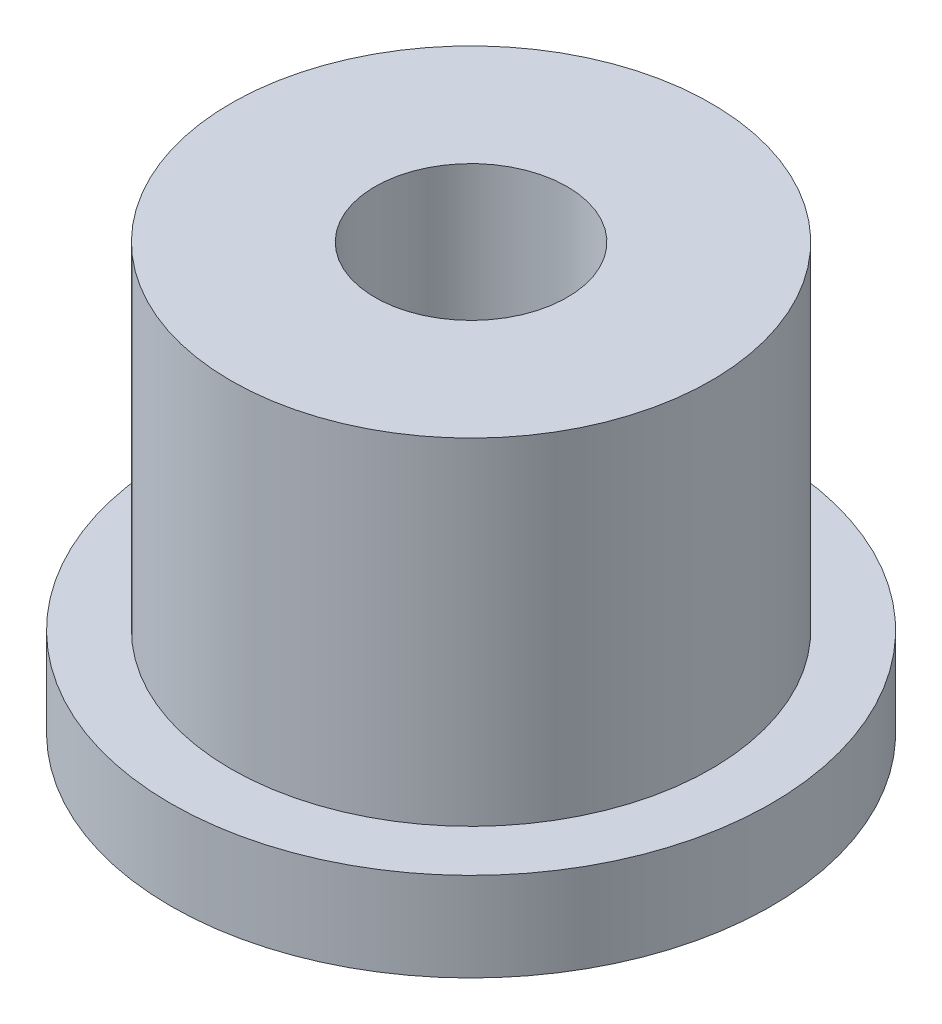
ISO-10303-21;
HEADER;
FILE_DESCRIPTION(('STEP AP214'),'2;1');
FILE_NAME('part.step','',(''),(''),'','','');
FILE_SCHEMA(('AUTOMOTIVE_DESIGN { 1 0 10303 214 1 1 1 1 }'));
ENDSEC;
DATA;
#1=APPLICATION_CONTEXT('core data for automotive mechanical design processes');
#2=APPLICATION_PROTOCOL_DEFINITION('international standard','automotive_design',2000,#1);
#3=PRODUCT_CONTEXT('',#1,'mechanical');
#4=PRODUCT('Part','Part','',(#3));
#5=PRODUCT_RELATED_PRODUCT_CATEGORY('part','',(#4));
#6=PRODUCT_DEFINITION_FORMATION('','',#4);
#7=PRODUCT_DEFINITION_CONTEXT('part definition',#1,'design');
#8=PRODUCT_DEFINITION('design','',#6,#7);
#9=PRODUCT_DEFINITION_SHAPE('','',#8);
#10=(LENGTH_UNIT() NAMED_UNIT(*) SI_UNIT(.MILLI.,.METRE.));
#11=(NAMED_UNIT(*) PLANE_ANGLE_UNIT() SI_UNIT($,.RADIAN.));
#12=(NAMED_UNIT(*) SI_UNIT($,.STERADIAN.) SOLID_ANGLE_UNIT());
#13=UNCERTAINTY_MEASURE_WITH_UNIT(LENGTH_MEASURE(1.E-05),#10,'distance_accuracy_value','');
#14=(GEOMETRIC_REPRESENTATION_CONTEXT(3) GLOBAL_UNCERTAINTY_ASSIGNED_CONTEXT((#13)) GLOBAL_UNIT_ASSIGNED_CONTEXT((#10,
#11,#12)) REPRESENTATION_CONTEXT('',''));
#15=CARTESIAN_POINT('',(0.,0.,0.));
#16=DIRECTION('',(0.,0.,1.));
#17=DIRECTION('',(1.,0.,0.));
#18=AXIS2_PLACEMENT_3D('',#15,#16,#17);
#19=CARTESIAN_POINT('',(0.,7.08,0.));
#20=DIRECTION('',(0.,-1.,0.));
#21=DIRECTION('',(0.,0.,-1.));
#22=AXIS2_PLACEMENT_3D('',#19,#20,#21);
#23=CYLINDRICAL_SURFACE('',#22,1.6);
#24=CARTESIAN_POINT('',(0.,7.08,0.));
#25=DIRECTION('',(0.,-1.,0.));
#26=DIRECTION('',(0.,0.,-1.));
#27=AXIS2_PLACEMENT_3D('',#24,#25,#26);
#28=CIRCLE('',#27,1.6);
#29=CARTESIAN_POINT('',(0.,7.08,-1.6));
#30=VERTEX_POINT('',#29);
#31=EDGE_CURVE('E48',#30,#30,#28,.T.);
#32=ORIENTED_EDGE('',*,*,#31,.F.);
#33=EDGE_LOOP('',(#32));
#34=FACE_BOUND('',#33,.T.);
#35=CARTESIAN_POINT('',(0.,2.,0.));
#36=DIRECTION('',(0.,-1.,0.));
#37=DIRECTION('',(0.,0.,-1.));
#38=AXIS2_PLACEMENT_3D('',#35,#36,#37);
#39=CIRCLE('',#38,1.6);
#40=CARTESIAN_POINT('',(0.,2.,-1.6));
#41=VERTEX_POINT('',#40);
#42=EDGE_CURVE('E34',#41,#41,#39,.F.);
#43=ORIENTED_EDGE('',*,*,#42,.F.);
#44=EDGE_LOOP('',(#43));
#45=FACE_BOUND('',#44,.T.);
#46=ADVANCED_FACE('F30',(#34,#45),#23,.F.);
#47=CARTESIAN_POINT('',(0.,1.48,0.));
#48=DIRECTION('',(0.,1.,0.));
#49=DIRECTION('',(0.,0.,1.));
#50=AXIS2_PLACEMENT_3D('',#47,#48,#49);
#51=PLANE('',#50);
#52=CARTESIAN_POINT('',(0.,1.48,0.));
#53=DIRECTION('',(0.,1.,0.));
#54=DIRECTION('',(0.,0.,1.));
#55=AXIS2_PLACEMENT_3D('',#52,#53,#54);
#56=CIRCLE('',#55,5.);
#57=CARTESIAN_POINT('',(0.,1.48,5.));
#58=VERTEX_POINT('',#57);
#59=EDGE_CURVE('E10',#58,#58,#56,.T.);
#60=ORIENTED_EDGE('',*,*,#59,.T.);
#61=EDGE_LOOP('',(#60));
#62=FACE_BOUND('',#61,.T.);
#63=CARTESIAN_POINT('',(0.,1.48,0.));
#64=DIRECTION('',(0.,1.,0.));
#65=DIRECTION('',(0.,0.,1.));
#66=AXIS2_PLACEMENT_3D('',#63,#64,#65);
#67=CIRCLE('',#66,4.);
#68=CARTESIAN_POINT('',(0.,1.48,4.));
#69=VERTEX_POINT('',#68);
#70=EDGE_CURVE('E45',#69,#69,#67,.T.);
#71=ORIENTED_EDGE('',*,*,#70,.F.);
#72=EDGE_LOOP('',(#71));
#73=FACE_BOUND('',#72,.T.);
#74=ADVANCED_FACE('F66',(#62,#73),#51,.T.);
#75=CARTESIAN_POINT('',(0.,1.48,0.));
#76=DIRECTION('',(0.,-1.,0.));
#77=DIRECTION('',(0.,0.,-1.));
#78=AXIS2_PLACEMENT_3D('',#75,#76,#77);
#79=CYLINDRICAL_SURFACE('',#78,5.);
#80=ORIENTED_EDGE('',*,*,#59,.F.);
#81=EDGE_LOOP('',(#80));
#82=FACE_BOUND('',#81,.T.);
#83=CARTESIAN_POINT('',(0.,0.,0.));
#84=DIRECTION('',(0.,1.,0.));
#85=DIRECTION('',(0.,0.,1.));
#86=AXIS2_PLACEMENT_3D('',#83,#84,#85);
#87=CIRCLE('',#86,5.);
#88=CARTESIAN_POINT('',(0.,0.,5.));
#89=VERTEX_POINT('',#88);
#90=EDGE_CURVE('E38',#89,#89,#87,.T.);
#91=ORIENTED_EDGE('',*,*,#90,.T.);
#92=EDGE_LOOP('',(#91));
#93=FACE_BOUND('',#92,.T.);
#94=ADVANCED_FACE('F32',(#82,#93),#79,.T.);
#95=CARTESIAN_POINT('',(0.,0.,0.));
#96=DIRECTION('',(0.,1.,0.));
#97=DIRECTION('',(0.,0.,1.));
#98=AXIS2_PLACEMENT_3D('',#95,#96,#97);
#99=PLANE('',#98);
#100=CARTESIAN_POINT('',(0.,0.,0.));
#101=DIRECTION('',(0.,-1.,0.));
#102=DIRECTION('',(0.,0.,-1.));
#103=AXIS2_PLACEMENT_3D('',#100,#101,#102);
#104=CIRCLE('',#103,3.);
#105=CARTESIAN_POINT('',(0.,0.,-3.));
#106=VERTEX_POINT('',#105);
#107=EDGE_CURVE('E53',#106,#106,#104,.T.);
#108=ORIENTED_EDGE('',*,*,#107,.F.);
#109=EDGE_LOOP('',(#108));
#110=FACE_BOUND('',#109,.T.);
#111=ORIENTED_EDGE('',*,*,#90,.F.);
#112=EDGE_LOOP('',(#111));
#113=FACE_BOUND('',#112,.T.);
#114=ADVANCED_FACE('F84',(#110,#113),#99,.F.);
#115=CARTESIAN_POINT('',(0.,7.08,0.));
#116=DIRECTION('',(0.,-1.,0.));
#117=DIRECTION('',(0.,0.,-1.));
#118=AXIS2_PLACEMENT_3D('',#115,#116,#117);
#119=CYLINDRICAL_SURFACE('',#118,4.);
#120=CARTESIAN_POINT('',(0.,7.08,0.));
#121=DIRECTION('',(0.,1.,0.));
#122=DIRECTION('',(0.,0.,1.));
#123=AXIS2_PLACEMENT_3D('',#120,#121,#122);
#124=CIRCLE('',#123,4.);
#125=CARTESIAN_POINT('',(0.,7.08,4.));
#126=VERTEX_POINT('',#125);
#127=EDGE_CURVE('E43',#126,#126,#124,.T.);
#128=ORIENTED_EDGE('',*,*,#127,.F.);
#129=EDGE_LOOP('',(#128));
#130=FACE_BOUND('',#129,.T.);
#131=ORIENTED_EDGE('',*,*,#70,.T.);
#132=EDGE_LOOP('',(#131));
#133=FACE_BOUND('',#132,.T.);
#134=ADVANCED_FACE('F81',(#130,#133),#119,.T.);
#135=CARTESIAN_POINT('',(0.,7.08,0.));
#136=DIRECTION('',(0.,1.,0.));
#137=DIRECTION('',(0.,0.,1.));
#138=AXIS2_PLACEMENT_3D('',#135,#136,#137);
#139=PLANE('',#138);
#140=ORIENTED_EDGE('',*,*,#31,.T.);
#141=EDGE_LOOP('',(#140));
#142=FACE_BOUND('',#141,.T.);
#143=ORIENTED_EDGE('',*,*,#127,.T.);
#144=EDGE_LOOP('',(#143));
#145=FACE_BOUND('',#144,.T.);
#146=ADVANCED_FACE('F78',(#142,#145),#139,.T.);
#147=CARTESIAN_POINT('',(0.,2.,0.));
#148=DIRECTION('',(0.,-1.,0.));
#149=DIRECTION('',(0.,0.,-1.));
#150=AXIS2_PLACEMENT_3D('',#147,#148,#149);
#151=PLANE('',#150);
#152=CARTESIAN_POINT('',(0.,2.,0.));
#153=DIRECTION('',(0.,-1.,0.));
#154=DIRECTION('',(0.,0.,-1.));
#155=AXIS2_PLACEMENT_3D('',#152,#153,#154);
#156=CIRCLE('',#155,3.);
#157=CARTESIAN_POINT('',(0.,2.,-3.));
#158=VERTEX_POINT('',#157);
#159=EDGE_CURVE('E56',#158,#158,#156,.T.);
#160=ORIENTED_EDGE('',*,*,#159,.T.);
#161=EDGE_LOOP('',(#160));
#162=FACE_BOUND('',#161,.T.);
#163=ORIENTED_EDGE('',*,*,#42,.T.);
#164=EDGE_LOOP('',(#163));
#165=FACE_BOUND('',#164,.T.);
#166=ADVANCED_FACE('F63',(#162,#165),#151,.T.);
#167=CARTESIAN_POINT('',(0.,2.,0.));
#168=DIRECTION('',(0.,-1.,0.));
#169=DIRECTION('',(0.,0.,-1.));
#170=AXIS2_PLACEMENT_3D('',#167,#168,#169);
#171=CYLINDRICAL_SURFACE('',#170,3.);
#172=ORIENTED_EDGE('',*,*,#159,.F.);
#173=EDGE_LOOP('',(#172));
#174=FACE_BOUND('',#173,.T.);
#175=ORIENTED_EDGE('',*,*,#107,.T.);
#176=EDGE_LOOP('',(#175));
#177=FACE_BOUND('',#176,.T.);
#178=ADVANCED_FACE('F76',(#174,#177),#171,.F.);
#179=CLOSED_SHELL('',(#46,#74,#94,#114,#134,#146,#166,#178));
#180=MANIFOLD_SOLID_BREP('B2',#179);
#181=ADVANCED_BREP_SHAPE_REPRESENTATION('',(#18,#180),#14);
#182=SHAPE_DEFINITION_REPRESENTATION(#9,#181);
ENDSEC;
END-ISO-10303-21;
